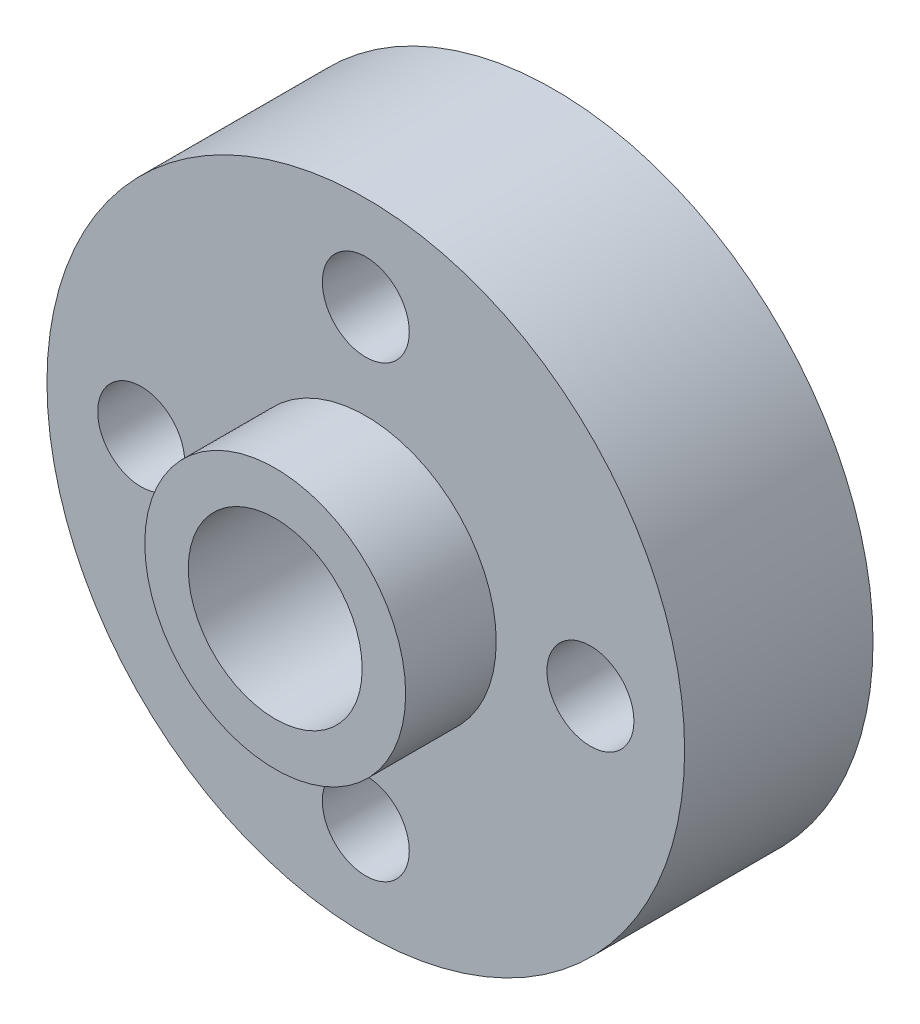
ISO-10303-21;
HEADER;
FILE_DESCRIPTION(('STEP AP214'),'2;1');
FILE_NAME('part.step','',(''),(''),'','','');
FILE_SCHEMA(('AUTOMOTIVE_DESIGN { 1 0 10303 214 1 1 1 1 }'));
ENDSEC;
DATA;
#1=APPLICATION_CONTEXT('core data for automotive mechanical design processes');
#2=APPLICATION_PROTOCOL_DEFINITION('international standard','automotive_design',2000,#1);
#3=PRODUCT_CONTEXT('',#1,'mechanical');
#4=PRODUCT('Part','Part','',(#3));
#5=PRODUCT_RELATED_PRODUCT_CATEGORY('part','',(#4));
#6=PRODUCT_DEFINITION_FORMATION('','',#4);
#7=PRODUCT_DEFINITION_CONTEXT('part definition',#1,'design');
#8=PRODUCT_DEFINITION('design','',#6,#7);
#9=PRODUCT_DEFINITION_SHAPE('','',#8);
#10=(LENGTH_UNIT() NAMED_UNIT(*) SI_UNIT(.MILLI.,.METRE.));
#11=(NAMED_UNIT(*) PLANE_ANGLE_UNIT() SI_UNIT($,.RADIAN.));
#12=(NAMED_UNIT(*) SI_UNIT($,.STERADIAN.) SOLID_ANGLE_UNIT());
#13=UNCERTAINTY_MEASURE_WITH_UNIT(LENGTH_MEASURE(1.E-05),#10,'distance_accuracy_value','');
#14=(GEOMETRIC_REPRESENTATION_CONTEXT(3) GLOBAL_UNCERTAINTY_ASSIGNED_CONTEXT((#13)) GLOBAL_UNIT_ASSIGNED_CONTEXT((#10,
#11,#12)) REPRESENTATION_CONTEXT('',''));
#15=CARTESIAN_POINT('',(0.,0.,0.));
#16=DIRECTION('',(0.,0.,1.));
#17=DIRECTION('',(1.,0.,0.));
#18=AXIS2_PLACEMENT_3D('',#15,#16,#17);
#19=CARTESIAN_POINT('',(0.,0.,0.));
#20=DIRECTION('',(0.,0.,1.));
#21=DIRECTION('',(1.,0.,0.));
#22=AXIS2_PLACEMENT_3D('',#19,#20,#21);
#23=PLANE('',#22);
#24=CARTESIAN_POINT('',(7.75,0.,0.));
#25=DIRECTION('',(0.,0.,1.));
#26=DIRECTION('',(1.,0.,0.));
#27=AXIS2_PLACEMENT_3D('',#24,#25,#26);
#28=CIRCLE('',#27,1.5);
#29=CARTESIAN_POINT('',(9.25,0.,0.));
#30=VERTEX_POINT('',#29);
#31=EDGE_CURVE('E78',#30,#30,#28,.F.);
#32=ORIENTED_EDGE('',*,*,#31,.F.);
#33=EDGE_LOOP('',(#32));
#34=FACE_BOUND('',#33,.T.);
#35=CARTESIAN_POINT('',(-7.75,0.,0.));
#36=DIRECTION('',(0.,0.,1.));
#37=DIRECTION('',(1.,0.,0.));
#38=AXIS2_PLACEMENT_3D('',#35,#36,#37);
#39=CIRCLE('',#38,1.5);
#40=CARTESIAN_POINT('',(-6.25,0.,0.));
#41=VERTEX_POINT('',#40);
#42=EDGE_CURVE('E72',#41,#41,#39,.F.);
#43=ORIENTED_EDGE('',*,*,#42,.F.);
#44=EDGE_LOOP('',(#43));
#45=FACE_BOUND('',#44,.T.);
#46=CARTESIAN_POINT('',(0.,-7.75,0.));
#47=DIRECTION('',(0.,0.,1.));
#48=DIRECTION('',(1.,0.,0.));
#49=AXIS2_PLACEMENT_3D('',#46,#47,#48);
#50=CIRCLE('',#49,1.5);
#51=CARTESIAN_POINT('',(1.5,-7.75,0.));
#52=VERTEX_POINT('',#51);
#53=EDGE_CURVE('E66',#52,#52,#50,.F.);
#54=ORIENTED_EDGE('',*,*,#53,.F.);
#55=EDGE_LOOP('',(#54));
#56=FACE_BOUND('',#55,.T.);
#57=CARTESIAN_POINT('',(0.,7.75,0.));
#58=DIRECTION('',(0.,0.,1.));
#59=DIRECTION('',(1.,0.,0.));
#60=AXIS2_PLACEMENT_3D('',#57,#58,#59);
#61=CIRCLE('',#60,1.5);
#62=CARTESIAN_POINT('',(1.5,7.75,0.));
#63=VERTEX_POINT('',#62);
#64=EDGE_CURVE('E60',#63,#63,#61,.F.);
#65=ORIENTED_EDGE('',*,*,#64,.F.);
#66=EDGE_LOOP('',(#65));
#67=FACE_BOUND('',#66,.T.);
#68=CARTESIAN_POINT('',(0.,0.,0.));
#69=DIRECTION('',(0.,0.,1.));
#70=DIRECTION('',(1.,0.,0.));
#71=AXIS2_PLACEMENT_3D('',#68,#69,#70);
#72=CIRCLE('',#71,11.);
#73=CARTESIAN_POINT('',(11.,0.,0.));
#74=VERTEX_POINT('',#73);
#75=EDGE_CURVE('E39',#74,#74,#72,.T.);
#76=ORIENTED_EDGE('',*,*,#75,.F.);
#77=EDGE_LOOP('',(#76));
#78=FACE_BOUND('',#77,.T.);
#79=CARTESIAN_POINT('',(0.,0.,0.));
#80=DIRECTION('',(0.,0.,1.));
#81=DIRECTION('',(1.,0.,0.));
#82=AXIS2_PLACEMENT_3D('',#79,#80,#81);
#83=CIRCLE('',#82,4.5);
#84=CARTESIAN_POINT('',(4.5,0.,0.));
#85=VERTEX_POINT('',#84);
#86=EDGE_CURVE('E10',#85,#85,#83,.F.);
#87=ORIENTED_EDGE('',*,*,#86,.F.);
#88=EDGE_LOOP('',(#87));
#89=FACE_BOUND('',#88,.T.);
#90=ADVANCED_FACE('F28',(#34,#45,#56,#67,#78,#89),#23,.F.);
#91=CARTESIAN_POINT('',(0.,0.,6.5));
#92=DIRECTION('',(0.,0.,1.));
#93=DIRECTION('',(1.,0.,0.));
#94=AXIS2_PLACEMENT_3D('',#91,#92,#93);
#95=PLANE('',#94);
#96=CARTESIAN_POINT('',(7.75,0.,6.5));
#97=DIRECTION('',(0.,0.,1.));
#98=DIRECTION('',(-1.,0.,0.));
#99=AXIS2_PLACEMENT_3D('',#96,#97,#98);
#100=CIRCLE('',#99,1.5);
#101=CARTESIAN_POINT('',(6.25,0.,6.5));
#102=VERTEX_POINT('',#101);
#103=EDGE_CURVE('E81',#102,#102,#100,.T.);
#104=ORIENTED_EDGE('',*,*,#103,.F.);
#105=EDGE_LOOP('',(#104));
#106=FACE_BOUND('',#105,.T.);
#107=CARTESIAN_POINT('',(-7.75,0.,6.5));
#108=DIRECTION('',(0.,0.,1.));
#109=DIRECTION('',(1.,0.,0.));
#110=AXIS2_PLACEMENT_3D('',#107,#108,#109);
#111=CIRCLE('',#110,1.5);
#112=CARTESIAN_POINT('',(-6.25,0.,6.5));
#113=VERTEX_POINT('',#112);
#114=EDGE_CURVE('E75',#113,#113,#111,.T.);
#115=ORIENTED_EDGE('',*,*,#114,.F.);
#116=EDGE_LOOP('',(#115));
#117=FACE_BOUND('',#116,.T.);
#118=CARTESIAN_POINT('',(0.,-7.75,6.5));
#119=DIRECTION('',(0.,0.,1.));
#120=DIRECTION('',(-1.,0.,0.));
#121=AXIS2_PLACEMENT_3D('',#118,#119,#120);
#122=CIRCLE('',#121,1.5);
#123=CARTESIAN_POINT('',(-1.5,-7.75,6.5));
#124=VERTEX_POINT('',#123);
#125=EDGE_CURVE('E69',#124,#124,#122,.T.);
#126=ORIENTED_EDGE('',*,*,#125,.F.);
#127=EDGE_LOOP('',(#126));
#128=FACE_BOUND('',#127,.T.);
#129=CARTESIAN_POINT('',(0.,7.75,6.5));
#130=DIRECTION('',(0.,0.,1.));
#131=DIRECTION('',(1.,0.,0.));
#132=AXIS2_PLACEMENT_3D('',#129,#130,#131);
#133=CIRCLE('',#132,1.5);
#134=CARTESIAN_POINT('',(1.5,7.75,6.5));
#135=VERTEX_POINT('',#134);
#136=EDGE_CURVE('E63',#135,#135,#133,.T.);
#137=ORIENTED_EDGE('',*,*,#136,.F.);
#138=EDGE_LOOP('',(#137));
#139=FACE_BOUND('',#138,.T.);
#140=CARTESIAN_POINT('',(0.,0.,6.5));
#141=DIRECTION('',(0.,0.,1.));
#142=DIRECTION('',(1.,0.,0.));
#143=AXIS2_PLACEMENT_3D('',#140,#141,#142);
#144=CIRCLE('',#143,11.);
#145=CARTESIAN_POINT('',(11.,0.,6.5));
#146=VERTEX_POINT('',#145);
#147=EDGE_CURVE('E35',#146,#146,#144,.T.);
#148=ORIENTED_EDGE('',*,*,#147,.T.);
#149=EDGE_LOOP('',(#148));
#150=FACE_BOUND('',#149,.T.);
#151=CARTESIAN_POINT('',(0.,0.,6.5));
#152=DIRECTION('',(0.,0.,1.));
#153=DIRECTION('',(1.,0.,0.));
#154=AXIS2_PLACEMENT_3D('',#151,#152,#153);
#155=CIRCLE('',#154,4.5);
#156=CARTESIAN_POINT('',(4.5,0.,6.5));
#157=VERTEX_POINT('',#156);
#158=EDGE_CURVE('E48',#157,#157,#155,.T.);
#159=ORIENTED_EDGE('',*,*,#158,.F.);
#160=EDGE_LOOP('',(#159));
#161=FACE_BOUND('',#160,.T.);
#162=ADVANCED_FACE('F88',(#106,#117,#128,#139,#150,#161),#95,.T.);
#163=CARTESIAN_POINT('',(0.,0.,6.5));
#164=DIRECTION('',(0.,0.,-1.));
#165=DIRECTION('',(-1.,0.,0.));
#166=AXIS2_PLACEMENT_3D('',#163,#164,#165);
#167=CYLINDRICAL_SURFACE('',#166,11.);
#168=ORIENTED_EDGE('',*,*,#147,.F.);
#169=EDGE_LOOP('',(#168));
#170=FACE_BOUND('',#169,.T.);
#171=ORIENTED_EDGE('',*,*,#75,.T.);
#172=EDGE_LOOP('',(#171));
#173=FACE_BOUND('',#172,.T.);
#174=ADVANCED_FACE('F30',(#170,#173),#167,.T.);
#175=CARTESIAN_POINT('',(0.,0.,6.5));
#176=DIRECTION('',(0.,0.,-1.));
#177=DIRECTION('',(-1.,0.,0.));
#178=AXIS2_PLACEMENT_3D('',#175,#176,#177);
#179=CYLINDRICAL_SURFACE('',#178,3.);
#180=CARTESIAN_POINT('',(0.,0.,9.625));
#181=DIRECTION('',(0.,0.,1.));
#182=DIRECTION('',(1.,0.,0.));
#183=AXIS2_PLACEMENT_3D('',#180,#181,#182);
#184=CIRCLE('',#183,3.);
#185=CARTESIAN_POINT('',(3.,0.,9.625));
#186=VERTEX_POINT('',#185);
#187=EDGE_CURVE('E51',#186,#186,#184,.T.);
#188=ORIENTED_EDGE('',*,*,#187,.T.);
#189=EDGE_LOOP('',(#188));
#190=FACE_BOUND('',#189,.T.);
#191=CARTESIAN_POINT('',(0.,0.,-3.125));
#192=DIRECTION('',(0.,0.,-1.));
#193=DIRECTION('',(-1.,0.,0.));
#194=AXIS2_PLACEMENT_3D('',#191,#192,#193);
#195=CIRCLE('',#194,3.);
#196=CARTESIAN_POINT('',(-3.,0.,-3.125));
#197=VERTEX_POINT('',#196);
#198=EDGE_CURVE('E57',#197,#197,#195,.T.);
#199=ORIENTED_EDGE('',*,*,#198,.T.);
#200=EDGE_LOOP('',(#199));
#201=FACE_BOUND('',#200,.T.);
#202=ADVANCED_FACE('F112',(#190,#201),#179,.F.);
#203=CARTESIAN_POINT('',(0.,0.,9.625));
#204=DIRECTION('',(0.,0.,1.));
#205=DIRECTION('',(1.,0.,0.));
#206=AXIS2_PLACEMENT_3D('',#203,#204,#205);
#207=PLANE('',#206);
#208=CARTESIAN_POINT('',(0.,0.,9.625));
#209=DIRECTION('',(0.,0.,1.));
#210=DIRECTION('',(1.,0.,0.));
#211=AXIS2_PLACEMENT_3D('',#208,#209,#210);
#212=CIRCLE('',#211,4.5);
#213=CARTESIAN_POINT('',(4.5,0.,9.625));
#214=VERTEX_POINT('',#213);
#215=EDGE_CURVE('E43',#214,#214,#212,.T.);
#216=ORIENTED_EDGE('',*,*,#215,.T.);
#217=EDGE_LOOP('',(#216));
#218=FACE_BOUND('',#217,.T.);
#219=ORIENTED_EDGE('',*,*,#187,.F.);
#220=EDGE_LOOP('',(#219));
#221=FACE_BOUND('',#220,.T.);
#222=ADVANCED_FACE('F102',(#218,#221),#207,.T.);
#223=CARTESIAN_POINT('',(0.,0.,9.625));
#224=DIRECTION('',(0.,0.,-1.));
#225=DIRECTION('',(-1.,0.,0.));
#226=AXIS2_PLACEMENT_3D('',#223,#224,#225);
#227=CYLINDRICAL_SURFACE('',#226,4.5);
#228=ORIENTED_EDGE('',*,*,#215,.F.);
#229=EDGE_LOOP('',(#228));
#230=FACE_BOUND('',#229,.T.);
#231=ORIENTED_EDGE('',*,*,#158,.T.);
#232=EDGE_LOOP('',(#231));
#233=FACE_BOUND('',#232,.T.);
#234=ADVANCED_FACE('F99',(#230,#233),#227,.T.);
#235=CARTESIAN_POINT('',(0.,0.,-3.125));
#236=DIRECTION('',(0.,0.,-1.));
#237=DIRECTION('',(-1.,0.,0.));
#238=AXIS2_PLACEMENT_3D('',#235,#236,#237);
#239=PLANE('',#238);
#240=CARTESIAN_POINT('',(0.,0.,-3.125));
#241=DIRECTION('',(0.,0.,-1.));
#242=DIRECTION('',(-1.,0.,0.));
#243=AXIS2_PLACEMENT_3D('',#240,#241,#242);
#244=CIRCLE('',#243,4.5);
#245=CARTESIAN_POINT('',(-4.5,0.,-3.125));
#246=VERTEX_POINT('',#245);
#247=EDGE_CURVE('E54',#246,#246,#244,.T.);
#248=ORIENTED_EDGE('',*,*,#247,.T.);
#249=EDGE_LOOP('',(#248));
#250=FACE_BOUND('',#249,.T.);
#251=ORIENTED_EDGE('',*,*,#198,.F.);
#252=EDGE_LOOP('',(#251));
#253=FACE_BOUND('',#252,.T.);
#254=ADVANCED_FACE('F101',(#250,#253),#239,.T.);
#255=CARTESIAN_POINT('',(0.,0.,-3.125));
#256=DIRECTION('',(0.,0.,1.));
#257=DIRECTION('',(1.,0.,0.));
#258=AXIS2_PLACEMENT_3D('',#255,#256,#257);
#259=CYLINDRICAL_SURFACE('',#258,4.5);
#260=ORIENTED_EDGE('',*,*,#247,.F.);
#261=EDGE_LOOP('',(#260));
#262=FACE_BOUND('',#261,.T.);
#263=ORIENTED_EDGE('',*,*,#86,.T.);
#264=EDGE_LOOP('',(#263));
#265=FACE_BOUND('',#264,.T.);
#266=ADVANCED_FACE('F109',(#262,#265),#259,.T.);
#267=CARTESIAN_POINT('',(0.,7.75,-3.126));
#268=DIRECTION('',(0.,0.,1.));
#269=DIRECTION('',(1.,0.,0.));
#270=AXIS2_PLACEMENT_3D('',#267,#268,#269);
#271=CYLINDRICAL_SURFACE('',#270,1.5);
#272=ORIENTED_EDGE('',*,*,#136,.T.);
#273=EDGE_LOOP('',(#272));
#274=FACE_BOUND('',#273,.T.);
#275=ORIENTED_EDGE('',*,*,#64,.T.);
#276=EDGE_LOOP('',(#275));
#277=FACE_BOUND('',#276,.T.);
#278=ADVANCED_FACE('F156',(#274,#277),#271,.F.);
#279=CARTESIAN_POINT('',(0.,-7.75,-3.126));
#280=DIRECTION('',(0.,0.,1.));
#281=DIRECTION('',(1.,0.,0.));
#282=AXIS2_PLACEMENT_3D('',#279,#280,#281);
#283=CYLINDRICAL_SURFACE('',#282,1.5);
#284=ORIENTED_EDGE('',*,*,#125,.T.);
#285=EDGE_LOOP('',(#284));
#286=FACE_BOUND('',#285,.T.);
#287=ORIENTED_EDGE('',*,*,#53,.T.);
#288=EDGE_LOOP('',(#287));
#289=FACE_BOUND('',#288,.T.);
#290=ADVANCED_FACE('F161',(#286,#289),#283,.F.);
#291=CARTESIAN_POINT('',(-7.75,0.,-3.126));
#292=DIRECTION('',(0.,0.,1.));
#293=DIRECTION('',(1.,0.,0.));
#294=AXIS2_PLACEMENT_3D('',#291,#292,#293);
#295=CYLINDRICAL_SURFACE('',#294,1.5);
#296=ORIENTED_EDGE('',*,*,#114,.T.);
#297=EDGE_LOOP('',(#296));
#298=FACE_BOUND('',#297,.T.);
#299=ORIENTED_EDGE('',*,*,#42,.T.);
#300=EDGE_LOOP('',(#299));
#301=FACE_BOUND('',#300,.T.);
#302=ADVANCED_FACE('F173',(#298,#301),#295,.F.);
#303=CARTESIAN_POINT('',(7.75,0.,-3.126));
#304=DIRECTION('',(0.,0.,1.));
#305=DIRECTION('',(1.,0.,0.));
#306=AXIS2_PLACEMENT_3D('',#303,#304,#305);
#307=CYLINDRICAL_SURFACE('',#306,1.5);
#308=ORIENTED_EDGE('',*,*,#103,.T.);
#309=EDGE_LOOP('',(#308));
#310=FACE_BOUND('',#309,.T.);
#311=ORIENTED_EDGE('',*,*,#31,.T.);
#312=EDGE_LOOP('',(#311));
#313=FACE_BOUND('',#312,.T.);
#314=ADVANCED_FACE('F85',(#310,#313),#307,.F.);
#315=CLOSED_SHELL('',(#90,#162,#174,#202,#222,#234,#254,#266,#278,#290,#302,#314));
#316=MANIFOLD_SOLID_BREP('B2',#315);
#317=ADVANCED_BREP_SHAPE_REPRESENTATION('',(#18,#316),#14);
#318=SHAPE_DEFINITION_REPRESENTATION(#9,#317);
ENDSEC;
END-ISO-10303-21;
